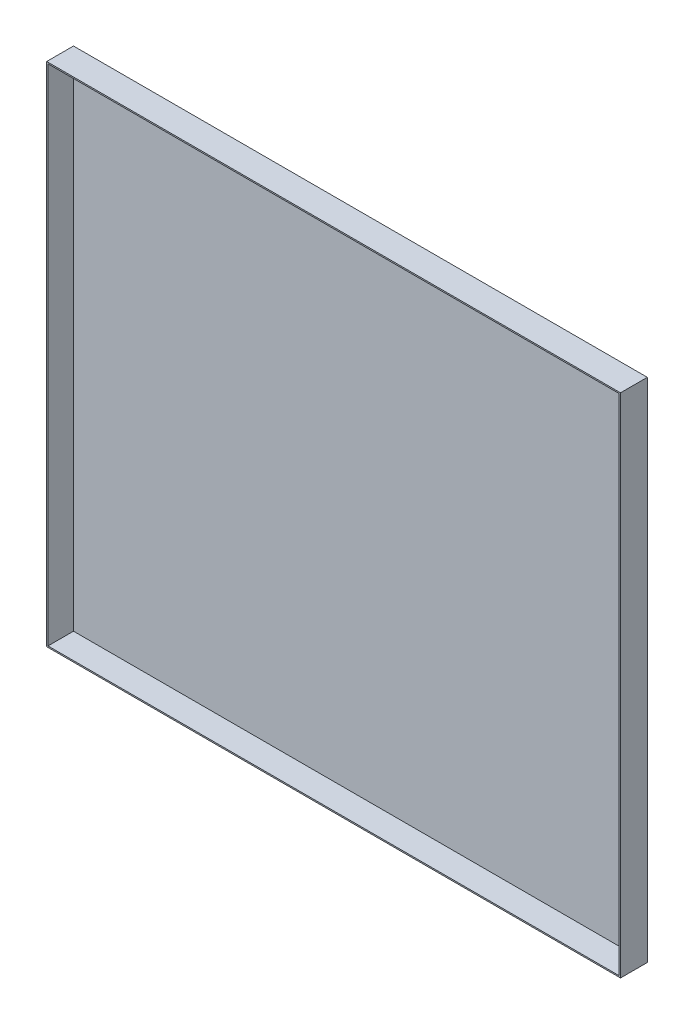
ISO-10303-21;
HEADER;
FILE_DESCRIPTION(('STEP AP214'),'2;1');
FILE_NAME('part.step','',(''),(''),'','','');
FILE_SCHEMA(('AUTOMOTIVE_DESIGN { 1 0 10303 214 1 1 1 1 }'));
ENDSEC;
DATA;
#1=APPLICATION_CONTEXT('core data for automotive mechanical design processes');
#2=APPLICATION_PROTOCOL_DEFINITION('international standard','automotive_design',2000,#1);
#3=PRODUCT_CONTEXT('',#1,'mechanical');
#4=PRODUCT('Part','Part','',(#3));
#5=PRODUCT_RELATED_PRODUCT_CATEGORY('part','',(#4));
#6=PRODUCT_DEFINITION_FORMATION('','',#4);
#7=PRODUCT_DEFINITION_CONTEXT('part definition',#1,'design');
#8=PRODUCT_DEFINITION('design','',#6,#7);
#9=PRODUCT_DEFINITION_SHAPE('','',#8);
#10=(LENGTH_UNIT() NAMED_UNIT(*) SI_UNIT(.MILLI.,.METRE.));
#11=(NAMED_UNIT(*) PLANE_ANGLE_UNIT() SI_UNIT($,.RADIAN.));
#12=(NAMED_UNIT(*) SI_UNIT($,.STERADIAN.) SOLID_ANGLE_UNIT());
#13=UNCERTAINTY_MEASURE_WITH_UNIT(LENGTH_MEASURE(1.E-05),#10,'distance_accuracy_value','');
#14=(GEOMETRIC_REPRESENTATION_CONTEXT(3) GLOBAL_UNCERTAINTY_ASSIGNED_CONTEXT((#13)) GLOBAL_UNIT_ASSIGNED_CONTEXT((#10,
#11,#12)) REPRESENTATION_CONTEXT('',''));
#15=CARTESIAN_POINT('',(0.,0.,0.));
#16=DIRECTION('',(0.,0.,1.));
#17=DIRECTION('',(1.,0.,0.));
#18=AXIS2_PLACEMENT_3D('',#15,#16,#17);
#19=CARTESIAN_POINT('',(214.,189.,20.));
#20=DIRECTION('',(-1.,0.,0.));
#21=DIRECTION('',(0.,-1.,0.));
#22=AXIS2_PLACEMENT_3D('',#19,#20,#21);
#23=PLANE('',#22);
#24=DIRECTION('',(0.,1.,0.));
#25=VECTOR('',#24,1.);
#26=CARTESIAN_POINT('',(214.,189.,0.));
#27=LINE('',#26,#25);
#28=CARTESIAN_POINT('',(214.,-189.,0.));
#29=VERTEX_POINT('',#28);
#30=CARTESIAN_POINT('',(214.,189.,0.));
#31=VERTEX_POINT('',#30);
#32=EDGE_CURVE('E167',#29,#31,#27,.T.);
#33=ORIENTED_EDGE('',*,*,#32,.T.);
#34=DIRECTION('',(0.,0.,-1.));
#35=VECTOR('',#34,1.);
#36=CARTESIAN_POINT('',(214.,189.,20.));
#37=LINE('',#36,#35);
#38=CARTESIAN_POINT('',(214.,189.,20.));
#39=VERTEX_POINT('',#38);
#40=EDGE_CURVE('E11',#39,#31,#37,.T.);
#41=ORIENTED_EDGE('',*,*,#40,.F.);
#42=DIRECTION('',(0.,1.,0.));
#43=VECTOR('',#42,1.);
#44=CARTESIAN_POINT('',(214.,189.,20.));
#45=LINE('',#44,#43);
#46=CARTESIAN_POINT('',(214.,-189.,20.));
#47=VERTEX_POINT('',#46);
#48=EDGE_CURVE('E156',#47,#39,#45,.T.);
#49=ORIENTED_EDGE('',*,*,#48,.F.);
#50=DIRECTION('',(0.,0.,-1.));
#51=VECTOR('',#50,1.);
#52=CARTESIAN_POINT('',(214.,-189.,20.));
#53=LINE('',#52,#51);
#54=EDGE_CURVE('E166',#47,#29,#53,.T.);
#55=ORIENTED_EDGE('',*,*,#54,.T.);
#56=EDGE_LOOP('',(#33,#41,#49,#55));
#57=FACE_BOUND('',#56,.T.);
#58=ADVANCED_FACE('F39',(#57),#23,.F.);
#59=CARTESIAN_POINT('',(-214.,189.,20.));
#60=DIRECTION('',(0.,-1.,0.));
#61=DIRECTION('',(0.,0.,-1.));
#62=AXIS2_PLACEMENT_3D('',#59,#60,#61);
#63=PLANE('',#62);
#64=DIRECTION('',(-1.,0.,0.));
#65=VECTOR('',#64,1.);
#66=CARTESIAN_POINT('',(-214.,189.,0.));
#67=LINE('',#66,#65);
#68=CARTESIAN_POINT('',(-214.,189.,0.));
#69=VERTEX_POINT('',#68);
#70=EDGE_CURVE('E171',#31,#69,#67,.T.);
#71=ORIENTED_EDGE('',*,*,#70,.T.);
#72=DIRECTION('',(0.,0.,-1.));
#73=VECTOR('',#72,1.);
#74=CARTESIAN_POINT('',(-214.,189.,20.));
#75=LINE('',#74,#73);
#76=CARTESIAN_POINT('',(-214.,189.,20.));
#77=VERTEX_POINT('',#76);
#78=EDGE_CURVE('E47',#77,#69,#75,.T.);
#79=ORIENTED_EDGE('',*,*,#78,.F.);
#80=DIRECTION('',(-1.,0.,0.));
#81=VECTOR('',#80,1.);
#82=CARTESIAN_POINT('',(-214.,189.,20.));
#83=LINE('',#82,#81);
#84=EDGE_CURVE('E91',#39,#77,#83,.T.);
#85=ORIENTED_EDGE('',*,*,#84,.F.);
#86=ORIENTED_EDGE('',*,*,#40,.T.);
#87=EDGE_LOOP('',(#71,#79,#85,#86));
#88=FACE_BOUND('',#87,.T.);
#89=ADVANCED_FACE('F206',(#88),#63,.F.);
#90=CARTESIAN_POINT('',(-214.,189.,20.));
#91=DIRECTION('',(1.,0.,0.));
#92=DIRECTION('',(0.,1.,0.));
#93=AXIS2_PLACEMENT_3D('',#90,#91,#92);
#94=PLANE('',#93);
#95=DIRECTION('',(0.,-1.,0.));
#96=VECTOR('',#95,1.);
#97=CARTESIAN_POINT('',(-214.,189.,0.));
#98=LINE('',#97,#96);
#99=CARTESIAN_POINT('',(-214.,-189.,0.));
#100=VERTEX_POINT('',#99);
#101=EDGE_CURVE('E174',#69,#100,#98,.T.);
#102=ORIENTED_EDGE('',*,*,#101,.T.);
#103=DIRECTION('',(0.,0.,-1.));
#104=VECTOR('',#103,1.);
#105=CARTESIAN_POINT('',(-214.,-189.,20.));
#106=LINE('',#105,#104);
#107=CARTESIAN_POINT('',(-214.,-189.,20.));
#108=VERTEX_POINT('',#107);
#109=EDGE_CURVE('E181',#108,#100,#106,.T.);
#110=ORIENTED_EDGE('',*,*,#109,.F.);
#111=DIRECTION('',(0.,-1.,0.));
#112=VECTOR('',#111,1.);
#113=CARTESIAN_POINT('',(-214.,189.,20.));
#114=LINE('',#113,#112);
#115=EDGE_CURVE('E161',#77,#108,#114,.T.);
#116=ORIENTED_EDGE('',*,*,#115,.F.);
#117=ORIENTED_EDGE('',*,*,#78,.T.);
#118=EDGE_LOOP('',(#102,#110,#116,#117));
#119=FACE_BOUND('',#118,.T.);
#120=ADVANCED_FACE('F188',(#119),#94,.F.);
#121=CARTESIAN_POINT('',(-214.,-189.,20.));
#122=DIRECTION('',(0.,1.,0.));
#123=DIRECTION('',(0.,0.,1.));
#124=AXIS2_PLACEMENT_3D('',#121,#122,#123);
#125=PLANE('',#124);
#126=DIRECTION('',(1.,0.,0.));
#127=VECTOR('',#126,1.);
#128=CARTESIAN_POINT('',(-214.,-189.,0.));
#129=LINE('',#128,#127);
#130=EDGE_CURVE('E84',#100,#29,#129,.T.);
#131=ORIENTED_EDGE('',*,*,#130,.T.);
#132=ORIENTED_EDGE('',*,*,#54,.F.);
#133=DIRECTION('',(1.,0.,0.));
#134=VECTOR('',#133,1.);
#135=CARTESIAN_POINT('',(-214.,-189.,20.));
#136=LINE('',#135,#134);
#137=EDGE_CURVE('E63',#108,#47,#136,.T.);
#138=ORIENTED_EDGE('',*,*,#137,.F.);
#139=ORIENTED_EDGE('',*,*,#109,.T.);
#140=EDGE_LOOP('',(#131,#132,#138,#139));
#141=FACE_BOUND('',#140,.T.);
#142=ADVANCED_FACE('F196',(#141),#125,.F.);
#143=CARTESIAN_POINT('',(0.,0.,20.));
#144=DIRECTION('',(0.,0.,1.));
#145=DIRECTION('',(1.,0.,0.));
#146=AXIS2_PLACEMENT_3D('',#143,#144,#145);
#147=PLANE('',#146);
#148=DIRECTION('',(0.,1.,0.));
#149=VECTOR('',#148,1.);
#150=CARTESIAN_POINT('',(213.,189.,20.));
#151=LINE('',#150,#149);
#152=CARTESIAN_POINT('',(213.,-188.,20.));
#153=VERTEX_POINT('',#152);
#154=CARTESIAN_POINT('',(213.,188.,20.));
#155=VERTEX_POINT('',#154);
#156=EDGE_CURVE('E140',#153,#155,#151,.T.);
#157=ORIENTED_EDGE('',*,*,#156,.F.);
#158=DIRECTION('',(1.,0.,0.));
#159=VECTOR('',#158,1.);
#160=CARTESIAN_POINT('',(-214.,-188.,20.));
#161=LINE('',#160,#159);
#162=CARTESIAN_POINT('',(-213.,-188.,20.));
#163=VERTEX_POINT('',#162);
#164=EDGE_CURVE('E153',#163,#153,#161,.T.);
#165=ORIENTED_EDGE('',*,*,#164,.F.);
#166=DIRECTION('',(0.,-1.,0.));
#167=VECTOR('',#166,1.);
#168=CARTESIAN_POINT('',(-213.,189.,20.));
#169=LINE('',#168,#167);
#170=CARTESIAN_POINT('',(-213.,188.,20.));
#171=VERTEX_POINT('',#170);
#172=EDGE_CURVE('E150',#171,#163,#169,.T.);
#173=ORIENTED_EDGE('',*,*,#172,.F.);
#174=DIRECTION('',(-1.,0.,0.));
#175=VECTOR('',#174,1.);
#176=CARTESIAN_POINT('',(-214.,188.,20.));
#177=LINE('',#176,#175);
#178=EDGE_CURVE('E129',#155,#171,#177,.T.);
#179=ORIENTED_EDGE('',*,*,#178,.F.);
#180=EDGE_LOOP('',(#157,#165,#173,#179));
#181=FACE_BOUND('',#180,.T.);
#182=ORIENTED_EDGE('',*,*,#48,.T.);
#183=ORIENTED_EDGE('',*,*,#84,.T.);
#184=ORIENTED_EDGE('',*,*,#115,.T.);
#185=ORIENTED_EDGE('',*,*,#137,.T.);
#186=EDGE_LOOP('',(#182,#183,#184,#185));
#187=FACE_BOUND('',#186,.T.);
#188=ADVANCED_FACE('F198',(#181,#187),#147,.T.);
#189=CARTESIAN_POINT('',(0.,0.,0.));
#190=DIRECTION('',(0.,0.,1.));
#191=DIRECTION('',(1.,0.,0.));
#192=AXIS2_PLACEMENT_3D('',#189,#190,#191);
#193=PLANE('',#192);
#194=ORIENTED_EDGE('',*,*,#32,.F.);
#195=ORIENTED_EDGE('',*,*,#130,.F.);
#196=ORIENTED_EDGE('',*,*,#101,.F.);
#197=ORIENTED_EDGE('',*,*,#70,.F.);
#198=EDGE_LOOP('',(#194,#195,#196,#197));
#199=FACE_BOUND('',#198,.T.);
#200=ADVANCED_FACE('F192',(#199),#193,.F.);
#201=CARTESIAN_POINT('',(213.,189.,20.));
#202=DIRECTION('',(-1.,0.,0.));
#203=DIRECTION('',(0.,-1.,0.));
#204=AXIS2_PLACEMENT_3D('',#201,#202,#203);
#205=PLANE('',#204);
#206=DIRECTION('',(0.,1.,0.));
#207=VECTOR('',#206,1.);
#208=CARTESIAN_POINT('',(213.,189.,1.));
#209=LINE('',#208,#207);
#210=CARTESIAN_POINT('',(213.,-188.,1.));
#211=VERTEX_POINT('',#210);
#212=CARTESIAN_POINT('',(213.,188.,1.));
#213=VERTEX_POINT('',#212);
#214=EDGE_CURVE('E119',#211,#213,#209,.T.);
#215=ORIENTED_EDGE('',*,*,#214,.F.);
#216=DIRECTION('',(0.,0.,-1.));
#217=VECTOR('',#216,1.);
#218=CARTESIAN_POINT('',(213.,-188.,20.));
#219=LINE('',#218,#217);
#220=EDGE_CURVE('E144',#153,#211,#219,.T.);
#221=ORIENTED_EDGE('',*,*,#220,.F.);
#222=ORIENTED_EDGE('',*,*,#156,.T.);
#223=DIRECTION('',(0.,0.,-1.));
#224=VECTOR('',#223,1.);
#225=CARTESIAN_POINT('',(213.,188.,20.));
#226=LINE('',#225,#224);
#227=EDGE_CURVE('E133',#155,#213,#226,.T.);
#228=ORIENTED_EDGE('',*,*,#227,.T.);
#229=EDGE_LOOP('',(#215,#221,#222,#228));
#230=FACE_BOUND('',#229,.T.);
#231=ADVANCED_FACE('F233',(#230),#205,.T.);
#232=CARTESIAN_POINT('',(-214.,188.,20.));
#233=DIRECTION('',(0.,-1.,0.));
#234=DIRECTION('',(0.,0.,-1.));
#235=AXIS2_PLACEMENT_3D('',#232,#233,#234);
#236=PLANE('',#235);
#237=DIRECTION('',(-1.,0.,0.));
#238=VECTOR('',#237,1.);
#239=CARTESIAN_POINT('',(-214.,188.,1.));
#240=LINE('',#239,#238);
#241=CARTESIAN_POINT('',(-213.,188.,1.));
#242=VERTEX_POINT('',#241);
#243=EDGE_CURVE('E113',#213,#242,#240,.T.);
#244=ORIENTED_EDGE('',*,*,#243,.F.);
#245=ORIENTED_EDGE('',*,*,#227,.F.);
#246=ORIENTED_EDGE('',*,*,#178,.T.);
#247=DIRECTION('',(0.,0.,-1.));
#248=VECTOR('',#247,1.);
#249=CARTESIAN_POINT('',(-213.,188.,20.));
#250=LINE('',#249,#248);
#251=EDGE_CURVE('E126',#171,#242,#250,.T.);
#252=ORIENTED_EDGE('',*,*,#251,.T.);
#253=EDGE_LOOP('',(#244,#245,#246,#252));
#254=FACE_BOUND('',#253,.T.);
#255=ADVANCED_FACE('F127',(#254),#236,.T.);
#256=CARTESIAN_POINT('',(-213.,189.,20.));
#257=DIRECTION('',(1.,0.,0.));
#258=DIRECTION('',(0.,1.,0.));
#259=AXIS2_PLACEMENT_3D('',#256,#257,#258);
#260=PLANE('',#259);
#261=DIRECTION('',(0.,-1.,0.));
#262=VECTOR('',#261,1.);
#263=CARTESIAN_POINT('',(-213.,189.,1.));
#264=LINE('',#263,#262);
#265=CARTESIAN_POINT('',(-213.,-188.,1.));
#266=VERTEX_POINT('',#265);
#267=EDGE_CURVE('E117',#242,#266,#264,.T.);
#268=ORIENTED_EDGE('',*,*,#267,.F.);
#269=ORIENTED_EDGE('',*,*,#251,.F.);
#270=ORIENTED_EDGE('',*,*,#172,.T.);
#271=DIRECTION('',(0.,0.,-1.));
#272=VECTOR('',#271,1.);
#273=CARTESIAN_POINT('',(-213.,-188.,20.));
#274=LINE('',#273,#272);
#275=EDGE_CURVE('E54',#163,#266,#274,.T.);
#276=ORIENTED_EDGE('',*,*,#275,.T.);
#277=EDGE_LOOP('',(#268,#269,#270,#276));
#278=FACE_BOUND('',#277,.T.);
#279=ADVANCED_FACE('F135',(#278),#260,.T.);
#280=CARTESIAN_POINT('',(-214.,-188.,20.));
#281=DIRECTION('',(0.,1.,0.));
#282=DIRECTION('',(0.,0.,1.));
#283=AXIS2_PLACEMENT_3D('',#280,#281,#282);
#284=PLANE('',#283);
#285=DIRECTION('',(1.,0.,0.));
#286=VECTOR('',#285,1.);
#287=CARTESIAN_POINT('',(-214.,-188.,1.));
#288=LINE('',#287,#286);
#289=EDGE_CURVE('E137',#266,#211,#288,.T.);
#290=ORIENTED_EDGE('',*,*,#289,.F.);
#291=ORIENTED_EDGE('',*,*,#275,.F.);
#292=ORIENTED_EDGE('',*,*,#164,.T.);
#293=ORIENTED_EDGE('',*,*,#220,.T.);
#294=EDGE_LOOP('',(#290,#291,#292,#293));
#295=FACE_BOUND('',#294,.T.);
#296=ADVANCED_FACE('F263',(#295),#284,.T.);
#297=CARTESIAN_POINT('',(0.,0.,1.));
#298=DIRECTION('',(0.,0.,1.));
#299=DIRECTION('',(1.,0.,0.));
#300=AXIS2_PLACEMENT_3D('',#297,#298,#299);
#301=PLANE('',#300);
#302=ORIENTED_EDGE('',*,*,#214,.T.);
#303=ORIENTED_EDGE('',*,*,#243,.T.);
#304=ORIENTED_EDGE('',*,*,#267,.T.);
#305=ORIENTED_EDGE('',*,*,#289,.T.);
#306=EDGE_LOOP('',(#302,#303,#304,#305));
#307=FACE_BOUND('',#306,.T.);
#308=ADVANCED_FACE('F115',(#307),#301,.T.);
#309=CLOSED_SHELL('',(#58,#89,#120,#142,#188,#200,#231,#255,#279,#296,#308));
#310=MANIFOLD_SOLID_BREP('B2',#309);
#311=ADVANCED_BREP_SHAPE_REPRESENTATION('',(#18,#310),#14);
#312=SHAPE_DEFINITION_REPRESENTATION(#9,#311);
ENDSEC;
END-ISO-10303-21;
